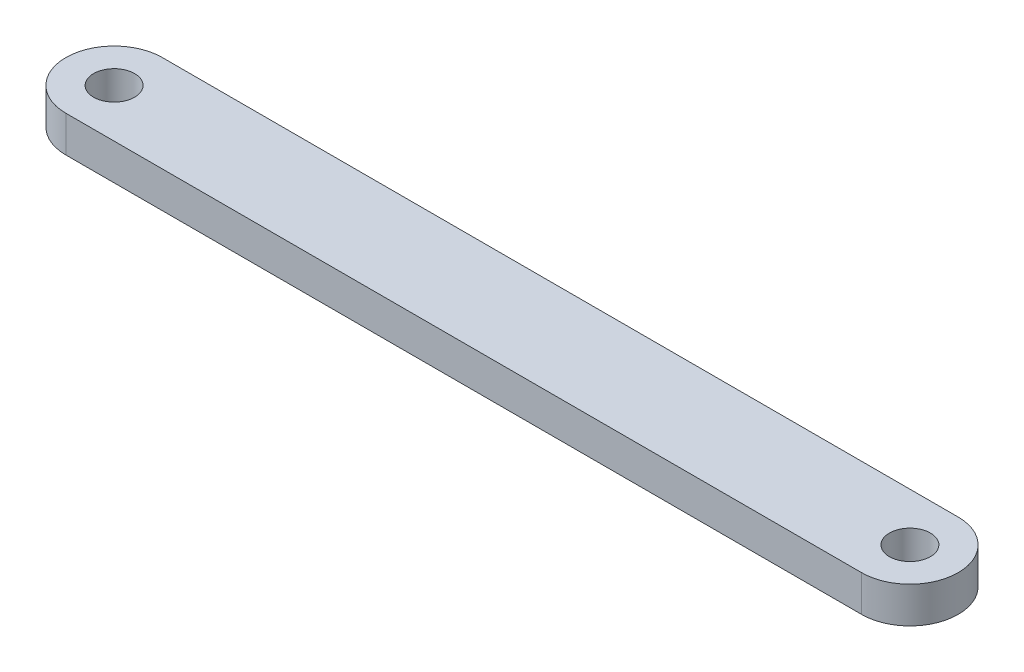
ISO-10303-21;
HEADER;
FILE_DESCRIPTION(('STEP AP214'),'2;1');
FILE_NAME('part.step','',(''),(''),'','','');
FILE_SCHEMA(('AUTOMOTIVE_DESIGN { 1 0 10303 214 1 1 1 1 }'));
ENDSEC;
DATA;
#1=APPLICATION_CONTEXT('core data for automotive mechanical design processes');
#2=APPLICATION_PROTOCOL_DEFINITION('international standard','automotive_design',2000,#1);
#3=PRODUCT_CONTEXT('',#1,'mechanical');
#4=PRODUCT('Part','Part','',(#3));
#5=PRODUCT_RELATED_PRODUCT_CATEGORY('part','',(#4));
#6=PRODUCT_DEFINITION_FORMATION('','',#4);
#7=PRODUCT_DEFINITION_CONTEXT('part definition',#1,'design');
#8=PRODUCT_DEFINITION('design','',#6,#7);
#9=PRODUCT_DEFINITION_SHAPE('','',#8);
#10=(LENGTH_UNIT() NAMED_UNIT(*) SI_UNIT(.MILLI.,.METRE.));
#11=(NAMED_UNIT(*) PLANE_ANGLE_UNIT() SI_UNIT($,.RADIAN.));
#12=(NAMED_UNIT(*) SI_UNIT($,.STERADIAN.) SOLID_ANGLE_UNIT());
#13=UNCERTAINTY_MEASURE_WITH_UNIT(LENGTH_MEASURE(1.E-05),#10,'distance_accuracy_value','');
#14=(GEOMETRIC_REPRESENTATION_CONTEXT(3) GLOBAL_UNCERTAINTY_ASSIGNED_CONTEXT((#13)) GLOBAL_UNIT_ASSIGNED_CONTEXT((#10,
#11,#12)) REPRESENTATION_CONTEXT('',''));
#15=CARTESIAN_POINT('',(0.,0.,0.));
#16=DIRECTION('',(0.,0.,1.));
#17=DIRECTION('',(1.,0.,0.));
#18=AXIS2_PLACEMENT_3D('',#15,#16,#17);
#19=CARTESIAN_POINT('',(-33.,3.,0.));
#20=DIRECTION('',(0.,1.,0.));
#21=DIRECTION('',(0.,0.,1.));
#22=AXIS2_PLACEMENT_3D('',#19,#20,#21);
#23=PLANE('',#22);
#24=CARTESIAN_POINT('',(-33.,3.,0.));
#25=DIRECTION('',(0.,1.,0.));
#26=DIRECTION('',(0.,0.,1.));
#27=AXIS2_PLACEMENT_3D('',#24,#25,#26);
#28=CIRCLE('',#27,1.7);
#29=CARTESIAN_POINT('',(-33.,3.,1.7));
#30=VERTEX_POINT('',#29);
#31=EDGE_CURVE('E102',#30,#30,#28,.T.);
#32=ORIENTED_EDGE('',*,*,#31,.F.);
#33=EDGE_LOOP('',(#32));
#34=FACE_BOUND('',#33,.T.);
#35=CARTESIAN_POINT('',(-33.,3.,0.));
#36=DIRECTION('',(0.,1.,0.));
#37=DIRECTION('',(0.,0.,1.));
#38=AXIS2_PLACEMENT_3D('',#35,#36,#37);
#39=CIRCLE('',#38,4.);
#40=CARTESIAN_POINT('',(-33.,3.,-4.));
#41=VERTEX_POINT('',#40);
#42=CARTESIAN_POINT('',(-33.,3.,4.));
#43=VERTEX_POINT('',#42);
#44=EDGE_CURVE('E87',#41,#43,#39,.T.);
#45=ORIENTED_EDGE('',*,*,#44,.T.);
#46=DIRECTION('',(1.,0.,0.));
#47=VECTOR('',#46,1.);
#48=CARTESIAN_POINT('',(-33.,3.,4.));
#49=LINE('',#48,#47);
#50=CARTESIAN_POINT('',(33.,3.,4.));
#51=VERTEX_POINT('',#50);
#52=EDGE_CURVE('E82',#43,#51,#49,.T.);
#53=ORIENTED_EDGE('',*,*,#52,.T.);
#54=CARTESIAN_POINT('',(33.,3.,0.));
#55=DIRECTION('',(0.,1.,0.));
#56=DIRECTION('',(0.,0.,1.));
#57=AXIS2_PLACEMENT_3D('',#54,#55,#56);
#58=CIRCLE('',#57,4.);
#59=CARTESIAN_POINT('',(33.,3.,-4.));
#60=VERTEX_POINT('',#59);
#61=EDGE_CURVE('E85',#51,#60,#58,.T.);
#62=ORIENTED_EDGE('',*,*,#61,.T.);
#63=DIRECTION('',(-1.,0.,0.));
#64=VECTOR('',#63,1.);
#65=CARTESIAN_POINT('',(-33.,3.,-4.));
#66=LINE('',#65,#64);
#67=EDGE_CURVE('E52',#60,#41,#66,.T.);
#68=ORIENTED_EDGE('',*,*,#67,.T.);
#69=EDGE_LOOP('',(#45,#53,#62,#68));
#70=FACE_BOUND('',#69,.T.);
#71=CARTESIAN_POINT('',(33.,3.,0.));
#72=DIRECTION('',(0.,1.,0.));
#73=DIRECTION('',(0.,0.,1.));
#74=AXIS2_PLACEMENT_3D('',#71,#72,#73);
#75=CIRCLE('',#74,1.7);
#76=CARTESIAN_POINT('',(33.,3.,1.7));
#77=VERTEX_POINT('',#76);
#78=EDGE_CURVE('E117',#77,#77,#75,.T.);
#79=ORIENTED_EDGE('',*,*,#78,.F.);
#80=EDGE_LOOP('',(#79));
#81=FACE_BOUND('',#80,.T.);
#82=ADVANCED_FACE('F35',(#34,#70,#81),#23,.T.);
#83=CARTESIAN_POINT('',(-33.,0.,0.));
#84=DIRECTION('',(0.,1.,0.));
#85=DIRECTION('',(0.,0.,1.));
#86=AXIS2_PLACEMENT_3D('',#83,#84,#85);
#87=PLANE('',#86);
#88=CARTESIAN_POINT('',(-33.,0.,0.));
#89=DIRECTION('',(0.,1.,0.));
#90=DIRECTION('',(0.,0.,1.));
#91=AXIS2_PLACEMENT_3D('',#88,#89,#90);
#92=CIRCLE('',#91,4.);
#93=CARTESIAN_POINT('',(-33.,0.,-4.));
#94=VERTEX_POINT('',#93);
#95=CARTESIAN_POINT('',(-33.,0.,4.));
#96=VERTEX_POINT('',#95);
#97=EDGE_CURVE('E99',#94,#96,#92,.T.);
#98=ORIENTED_EDGE('',*,*,#97,.F.);
#99=DIRECTION('',(-1.,0.,0.));
#100=VECTOR('',#99,1.);
#101=CARTESIAN_POINT('',(-33.,0.,-4.));
#102=LINE('',#101,#100);
#103=CARTESIAN_POINT('',(33.,0.,-4.));
#104=VERTEX_POINT('',#103);
#105=EDGE_CURVE('E75',#104,#94,#102,.T.);
#106=ORIENTED_EDGE('',*,*,#105,.F.);
#107=CARTESIAN_POINT('',(33.,0.,0.));
#108=DIRECTION('',(0.,1.,0.));
#109=DIRECTION('',(0.,0.,1.));
#110=AXIS2_PLACEMENT_3D('',#107,#108,#109);
#111=CIRCLE('',#110,4.);
#112=CARTESIAN_POINT('',(33.,0.,4.));
#113=VERTEX_POINT('',#112);
#114=EDGE_CURVE('E69',#113,#104,#111,.T.);
#115=ORIENTED_EDGE('',*,*,#114,.F.);
#116=DIRECTION('',(1.,0.,0.));
#117=VECTOR('',#116,1.);
#118=CARTESIAN_POINT('',(-33.,0.,4.));
#119=LINE('',#118,#117);
#120=EDGE_CURVE('E91',#96,#113,#119,.T.);
#121=ORIENTED_EDGE('',*,*,#120,.F.);
#122=EDGE_LOOP('',(#98,#106,#115,#121));
#123=FACE_BOUND('',#122,.T.);
#124=CARTESIAN_POINT('',(-33.,0.,0.));
#125=DIRECTION('',(0.,1.,0.));
#126=DIRECTION('',(0.,0.,1.));
#127=AXIS2_PLACEMENT_3D('',#124,#125,#126);
#128=CIRCLE('',#127,1.7);
#129=CARTESIAN_POINT('',(-33.,0.,1.7));
#130=VERTEX_POINT('',#129);
#131=EDGE_CURVE('E114',#130,#130,#128,.T.);
#132=ORIENTED_EDGE('',*,*,#131,.T.);
#133=EDGE_LOOP('',(#132));
#134=FACE_BOUND('',#133,.T.);
#135=CARTESIAN_POINT('',(33.,0.,0.));
#136=DIRECTION('',(0.,1.,0.));
#137=DIRECTION('',(0.,0.,1.));
#138=AXIS2_PLACEMENT_3D('',#135,#136,#137);
#139=CIRCLE('',#138,1.7);
#140=CARTESIAN_POINT('',(33.,0.,1.7));
#141=VERTEX_POINT('',#140);
#142=EDGE_CURVE('E120',#141,#141,#139,.T.);
#143=ORIENTED_EDGE('',*,*,#142,.T.);
#144=EDGE_LOOP('',(#143));
#145=FACE_BOUND('',#144,.T.);
#146=ADVANCED_FACE('F110',(#123,#134,#145),#87,.F.);
#147=CARTESIAN_POINT('',(-33.,3.,0.));
#148=DIRECTION('',(0.,-1.,0.));
#149=DIRECTION('',(0.,0.,-1.));
#150=AXIS2_PLACEMENT_3D('',#147,#148,#149);
#151=CYLINDRICAL_SURFACE('',#150,4.);
#152=ORIENTED_EDGE('',*,*,#97,.T.);
#153=DIRECTION('',(0.,-1.,0.));
#154=VECTOR('',#153,1.);
#155=CARTESIAN_POINT('',(-33.,3.,4.));
#156=LINE('',#155,#154);
#157=EDGE_CURVE('E11',#43,#96,#156,.T.);
#158=ORIENTED_EDGE('',*,*,#157,.F.);
#159=ORIENTED_EDGE('',*,*,#44,.F.);
#160=DIRECTION('',(0.,-1.,0.));
#161=VECTOR('',#160,1.);
#162=CARTESIAN_POINT('',(-33.,3.,-4.));
#163=LINE('',#162,#161);
#164=EDGE_CURVE('E95',#41,#94,#163,.T.);
#165=ORIENTED_EDGE('',*,*,#164,.T.);
#166=EDGE_LOOP('',(#152,#158,#159,#165));
#167=FACE_BOUND('',#166,.T.);
#168=ADVANCED_FACE('F37',(#167),#151,.T.);
#169=CARTESIAN_POINT('',(-33.,3.,4.));
#170=DIRECTION('',(0.,0.,-1.));
#171=DIRECTION('',(-1.,0.,0.));
#172=AXIS2_PLACEMENT_3D('',#169,#170,#171);
#173=PLANE('',#172);
#174=ORIENTED_EDGE('',*,*,#120,.T.);
#175=DIRECTION('',(0.,-1.,0.));
#176=VECTOR('',#175,1.);
#177=CARTESIAN_POINT('',(33.,3.,4.));
#178=LINE('',#177,#176);
#179=EDGE_CURVE('E44',#51,#113,#178,.T.);
#180=ORIENTED_EDGE('',*,*,#179,.F.);
#181=ORIENTED_EDGE('',*,*,#52,.F.);
#182=ORIENTED_EDGE('',*,*,#157,.T.);
#183=EDGE_LOOP('',(#174,#180,#181,#182));
#184=FACE_BOUND('',#183,.T.);
#185=ADVANCED_FACE('F90',(#184),#173,.F.);
#186=CARTESIAN_POINT('',(33.,3.,0.));
#187=DIRECTION('',(0.,-1.,0.));
#188=DIRECTION('',(0.,0.,-1.));
#189=AXIS2_PLACEMENT_3D('',#186,#187,#188);
#190=CYLINDRICAL_SURFACE('',#189,4.);
#191=ORIENTED_EDGE('',*,*,#114,.T.);
#192=DIRECTION('',(0.,-1.,0.));
#193=VECTOR('',#192,1.);
#194=CARTESIAN_POINT('',(33.,3.,-4.));
#195=LINE('',#194,#193);
#196=EDGE_CURVE('E92',#60,#104,#195,.T.);
#197=ORIENTED_EDGE('',*,*,#196,.F.);
#198=ORIENTED_EDGE('',*,*,#61,.F.);
#199=ORIENTED_EDGE('',*,*,#179,.T.);
#200=EDGE_LOOP('',(#191,#197,#198,#199));
#201=FACE_BOUND('',#200,.T.);
#202=ADVANCED_FACE('F93',(#201),#190,.T.);
#203=CARTESIAN_POINT('',(-33.,3.,-4.));
#204=DIRECTION('',(0.,0.,1.));
#205=DIRECTION('',(1.,0.,0.));
#206=AXIS2_PLACEMENT_3D('',#203,#204,#205);
#207=PLANE('',#206);
#208=ORIENTED_EDGE('',*,*,#105,.T.);
#209=ORIENTED_EDGE('',*,*,#164,.F.);
#210=ORIENTED_EDGE('',*,*,#67,.F.);
#211=ORIENTED_EDGE('',*,*,#196,.T.);
#212=EDGE_LOOP('',(#208,#209,#210,#211));
#213=FACE_BOUND('',#212,.T.);
#214=ADVANCED_FACE('F107',(#213),#207,.F.);
#215=CARTESIAN_POINT('',(-33.,3.,0.));
#216=DIRECTION('',(0.,-1.,0.));
#217=DIRECTION('',(0.,0.,-1.));
#218=AXIS2_PLACEMENT_3D('',#215,#216,#217);
#219=CYLINDRICAL_SURFACE('',#218,1.7);
#220=ORIENTED_EDGE('',*,*,#31,.T.);
#221=EDGE_LOOP('',(#220));
#222=FACE_BOUND('',#221,.T.);
#223=ORIENTED_EDGE('',*,*,#131,.F.);
#224=EDGE_LOOP('',(#223));
#225=FACE_BOUND('',#224,.T.);
#226=ADVANCED_FACE('F137',(#222,#225),#219,.F.);
#227=CARTESIAN_POINT('',(33.,3.,0.));
#228=DIRECTION('',(0.,-1.,0.));
#229=DIRECTION('',(0.,0.,-1.));
#230=AXIS2_PLACEMENT_3D('',#227,#228,#229);
#231=CYLINDRICAL_SURFACE('',#230,1.7);
#232=ORIENTED_EDGE('',*,*,#78,.T.);
#233=EDGE_LOOP('',(#232));
#234=FACE_BOUND('',#233,.T.);
#235=ORIENTED_EDGE('',*,*,#142,.F.);
#236=EDGE_LOOP('',(#235));
#237=FACE_BOUND('',#236,.T.);
#238=ADVANCED_FACE('F126',(#234,#237),#231,.F.);
#239=CLOSED_SHELL('',(#82,#146,#168,#185,#202,#214,#226,#238));
#240=MANIFOLD_SOLID_BREP('B2',#239);
#241=ADVANCED_BREP_SHAPE_REPRESENTATION('',(#18,#240),#14);
#242=SHAPE_DEFINITION_REPRESENTATION(#9,#241);
ENDSEC;
END-ISO-10303-21;
